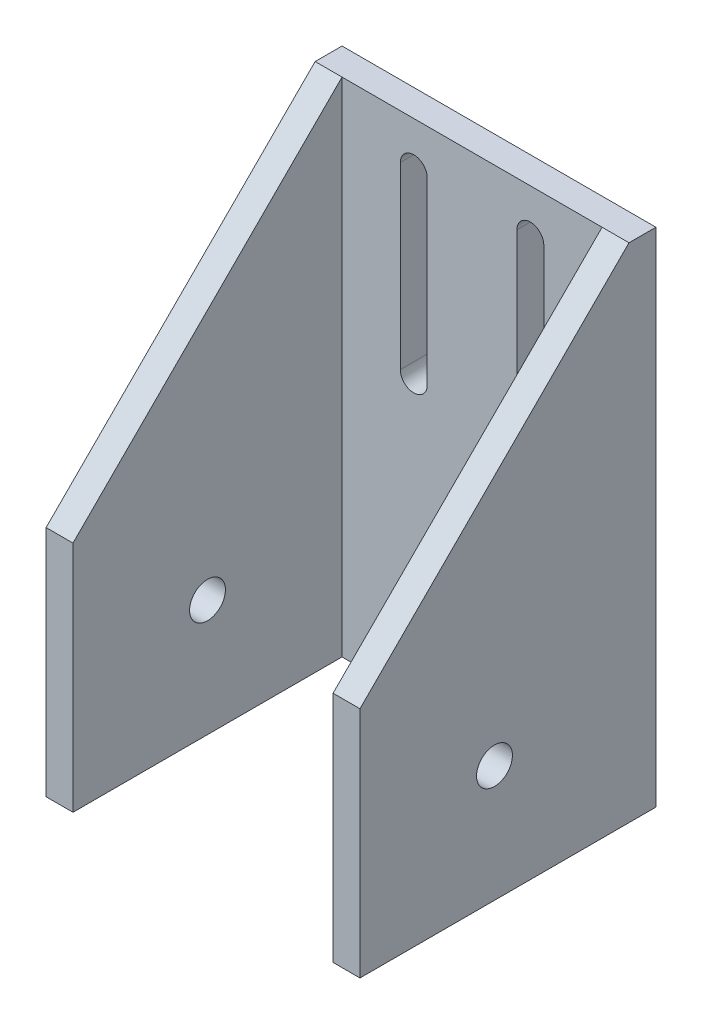
ISO-10303-21;
HEADER;
FILE_DESCRIPTION(('STEP AP214'),'2;1');
FILE_NAME('part.step','',(''),(''),'','','');
FILE_SCHEMA(('AUTOMOTIVE_DESIGN { 1 0 10303 214 1 1 1 1 }'));
ENDSEC;
DATA;
#1=APPLICATION_CONTEXT('core data for automotive mechanical design processes');
#2=APPLICATION_PROTOCOL_DEFINITION('international standard','automotive_design',2000,#1);
#3=PRODUCT_CONTEXT('',#1,'mechanical');
#4=PRODUCT('Part','Part','',(#3));
#5=PRODUCT_RELATED_PRODUCT_CATEGORY('part','',(#4));
#6=PRODUCT_DEFINITION_FORMATION('','',#4);
#7=PRODUCT_DEFINITION_CONTEXT('part definition',#1,'design');
#8=PRODUCT_DEFINITION('design','',#6,#7);
#9=PRODUCT_DEFINITION_SHAPE('','',#8);
#10=(LENGTH_UNIT() NAMED_UNIT(*) SI_UNIT(.MILLI.,.METRE.));
#11=(NAMED_UNIT(*) PLANE_ANGLE_UNIT() SI_UNIT($,.RADIAN.));
#12=(NAMED_UNIT(*) SI_UNIT($,.STERADIAN.) SOLID_ANGLE_UNIT());
#13=UNCERTAINTY_MEASURE_WITH_UNIT(LENGTH_MEASURE(1.E-05),#10,'distance_accuracy_value','');
#14=(GEOMETRIC_REPRESENTATION_CONTEXT(3) GLOBAL_UNCERTAINTY_ASSIGNED_CONTEXT((#13)) GLOBAL_UNIT_ASSIGNED_CONTEXT((#10,
#11,#12)) REPRESENTATION_CONTEXT('',''));
#15=CARTESIAN_POINT('',(0.,0.,0.));
#16=DIRECTION('',(0.,0.,1.));
#17=DIRECTION('',(1.,0.,0.));
#18=AXIS2_PLACEMENT_3D('',#15,#16,#17);
#19=CARTESIAN_POINT('',(17.5,28.,3.));
#20=DIRECTION('',(0.,0.707106781186547,0.707106781186547));
#21=DIRECTION('',(0.,-0.707106781186548,0.707106781186548));
#22=AXIS2_PLACEMENT_3D('',#19,#20,#21);
#23=PLANE('',#22);
#24=DIRECTION('',(0.,-0.707106781186548,0.707106781186548));
#25=VECTOR('',#24,1.);
#26=CARTESIAN_POINT('',(-14.5,28.,3.));
#27=LINE('',#26,#25);
#28=CARTESIAN_POINT('',(-14.5,28.,3.));
#29=VERTEX_POINT('',#28);
#30=CARTESIAN_POINT('',(-14.5,-2.,33.));
#31=VERTEX_POINT('',#30);
#32=EDGE_CURVE('E155',#29,#31,#27,.T.);
#33=ORIENTED_EDGE('',*,*,#32,.F.);
#34=DIRECTION('',(-1.,0.,0.));
#35=VECTOR('',#34,1.);
#36=CARTESIAN_POINT('',(-17.5,28.,3.));
#37=LINE('',#36,#35);
#38=CARTESIAN_POINT('',(-17.5,28.,3.));
#39=VERTEX_POINT('',#38);
#40=EDGE_CURVE('E258',#29,#39,#37,.T.);
#41=ORIENTED_EDGE('',*,*,#40,.T.);
#42=DIRECTION('',(0.,0.707106781186547,-0.707106781186547));
#43=VECTOR('',#42,1.);
#44=CARTESIAN_POINT('',(-17.5,28.,3.));
#45=LINE('',#44,#43);
#46=CARTESIAN_POINT('',(-17.5,-2.,33.));
#47=VERTEX_POINT('',#46);
#48=EDGE_CURVE('E163',#47,#39,#45,.T.);
#49=ORIENTED_EDGE('',*,*,#48,.F.);
#50=DIRECTION('',(-1.,0.,0.));
#51=VECTOR('',#50,1.);
#52=CARTESIAN_POINT('',(-17.5,-2.,33.));
#53=LINE('',#52,#51);
#54=EDGE_CURVE('E167',#31,#47,#53,.T.);
#55=ORIENTED_EDGE('',*,*,#54,.F.);
#56=EDGE_LOOP('',(#33,#41,#49,#55));
#57=FACE_BOUND('',#56,.T.);
#58=ADVANCED_FACE('F37',(#57),#23,.T.);
#59=CARTESIAN_POINT('',(0.,0.,3.));
#60=DIRECTION('',(0.,0.,1.));
#61=DIRECTION('',(1.,0.,0.));
#62=AXIS2_PLACEMENT_3D('',#59,#60,#61);
#63=PLANE('',#62);
#64=DIRECTION('',(0.,-1.,0.));
#65=VECTOR('',#64,1.);
#66=CARTESIAN_POINT('',(14.5,-2.,3.));
#67=LINE('',#66,#65);
#68=CARTESIAN_POINT('',(14.5,28.,3.));
#69=VERTEX_POINT('',#68);
#70=CARTESIAN_POINT('',(14.5,-28.,3.));
#71=VERTEX_POINT('',#70);
#72=EDGE_CURVE('E184',#69,#71,#67,.T.);
#73=ORIENTED_EDGE('',*,*,#72,.F.);
#74=DIRECTION('',(1.,0.,0.));
#75=VECTOR('',#74,1.);
#76=CARTESIAN_POINT('',(-14.5,28.,3.));
#77=LINE('',#76,#75);
#78=EDGE_CURVE('E322',#29,#69,#77,.T.);
#79=ORIENTED_EDGE('',*,*,#78,.F.);
#80=DIRECTION('',(0.,1.,0.));
#81=VECTOR('',#80,1.);
#82=CARTESIAN_POINT('',(-14.5,-2.,3.));
#83=LINE('',#82,#81);
#84=CARTESIAN_POINT('',(-14.5,-28.,3.));
#85=VERTEX_POINT('',#84);
#86=EDGE_CURVE('E58',#85,#29,#83,.T.);
#87=ORIENTED_EDGE('',*,*,#86,.F.);
#88=DIRECTION('',(1.,0.,0.));
#89=VECTOR('',#88,1.);
#90=CARTESIAN_POINT('',(-17.5,-28.,3.));
#91=LINE('',#90,#89);
#92=EDGE_CURVE('E53',#85,#71,#91,.T.);
#93=ORIENTED_EDGE('',*,*,#92,.T.);
#94=EDGE_LOOP('',(#73,#79,#87,#93));
#95=FACE_BOUND('',#94,.T.);
#96=CARTESIAN_POINT('',(6.5,23.,3.));
#97=DIRECTION('',(0.,0.,1.));
#98=DIRECTION('',(-1.,0.,0.));
#99=AXIS2_PLACEMENT_3D('',#96,#97,#98);
#100=CIRCLE('',#99,1.5);
#101=CARTESIAN_POINT('',(8.,23.,3.));
#102=VERTEX_POINT('',#101);
#103=CARTESIAN_POINT('',(5.,23.,3.));
#104=VERTEX_POINT('',#103);
#105=EDGE_CURVE('E187',#102,#104,#100,.T.);
#106=ORIENTED_EDGE('',*,*,#105,.F.);
#107=DIRECTION('',(0.,1.,0.));
#108=VECTOR('',#107,1.);
#109=CARTESIAN_POINT('',(8.,23.,3.));
#110=LINE('',#109,#108);
#111=CARTESIAN_POINT('',(8.,3.,3.));
#112=VERTEX_POINT('',#111);
#113=EDGE_CURVE('E197',#112,#102,#110,.T.);
#114=ORIENTED_EDGE('',*,*,#113,.F.);
#115=CARTESIAN_POINT('',(6.5,3.,3.));
#116=DIRECTION('',(0.,0.,1.));
#117=DIRECTION('',(-1.,0.,0.));
#118=AXIS2_PLACEMENT_3D('',#115,#116,#117);
#119=CIRCLE('',#118,1.5);
#120=CARTESIAN_POINT('',(5.,3.,3.));
#121=VERTEX_POINT('',#120);
#122=EDGE_CURVE('E194',#121,#112,#119,.T.);
#123=ORIENTED_EDGE('',*,*,#122,.F.);
#124=DIRECTION('',(0.,-1.,0.));
#125=VECTOR('',#124,1.);
#126=CARTESIAN_POINT('',(5.,23.,3.));
#127=LINE('',#126,#125);
#128=EDGE_CURVE('E190',#104,#121,#127,.T.);
#129=ORIENTED_EDGE('',*,*,#128,.F.);
#130=EDGE_LOOP('',(#106,#114,#123,#129));
#131=FACE_BOUND('',#130,.T.);
#132=CARTESIAN_POINT('',(-6.5,23.,3.));
#133=DIRECTION('',(0.,0.,1.));
#134=DIRECTION('',(1.,0.,0.));
#135=AXIS2_PLACEMENT_3D('',#132,#133,#134);
#136=CIRCLE('',#135,1.5);
#137=CARTESIAN_POINT('',(-5.,23.,3.));
#138=VERTEX_POINT('',#137);
#139=CARTESIAN_POINT('',(-8.,23.,3.));
#140=VERTEX_POINT('',#139);
#141=EDGE_CURVE('E221',#138,#140,#136,.T.);
#142=ORIENTED_EDGE('',*,*,#141,.F.);
#143=DIRECTION('',(0.,1.,0.));
#144=VECTOR('',#143,1.);
#145=CARTESIAN_POINT('',(-5.,23.,3.));
#146=LINE('',#145,#144);
#147=CARTESIAN_POINT('',(-4.99999999999999,3.,3.));
#148=VERTEX_POINT('',#147);
#149=EDGE_CURVE('E231',#148,#138,#146,.T.);
#150=ORIENTED_EDGE('',*,*,#149,.F.);
#151=CARTESIAN_POINT('',(-6.5,3.,3.));
#152=DIRECTION('',(0.,0.,1.));
#153=DIRECTION('',(1.,0.,0.));
#154=AXIS2_PLACEMENT_3D('',#151,#152,#153);
#155=CIRCLE('',#154,1.5);
#156=CARTESIAN_POINT('',(-8.,3.,3.));
#157=VERTEX_POINT('',#156);
#158=EDGE_CURVE('E228',#157,#148,#155,.T.);
#159=ORIENTED_EDGE('',*,*,#158,.F.);
#160=DIRECTION('',(0.,-1.,0.));
#161=VECTOR('',#160,1.);
#162=CARTESIAN_POINT('',(-8.,23.,3.));
#163=LINE('',#162,#161);
#164=EDGE_CURVE('E224',#140,#157,#163,.T.);
#165=ORIENTED_EDGE('',*,*,#164,.F.);
#166=EDGE_LOOP('',(#142,#150,#159,#165));
#167=FACE_BOUND('',#166,.T.);
#168=ADVANCED_FACE('F355',(#95,#131,#167),#63,.T.);
#169=CARTESIAN_POINT('',(0.,0.,0.));
#170=DIRECTION('',(0.,0.,1.));
#171=DIRECTION('',(1.,0.,0.));
#172=AXIS2_PLACEMENT_3D('',#169,#170,#171);
#173=PLANE('',#172);
#174=CARTESIAN_POINT('',(-6.5,23.,0.));
#175=DIRECTION('',(0.,0.,1.));
#176=DIRECTION('',(1.,0.,0.));
#177=AXIS2_PLACEMENT_3D('',#174,#175,#176);
#178=CIRCLE('',#177,1.5);
#179=CARTESIAN_POINT('',(-5.,23.,0.));
#180=VERTEX_POINT('',#179);
#181=CARTESIAN_POINT('',(-8.,23.,0.));
#182=VERTEX_POINT('',#181);
#183=EDGE_CURVE('E220',#180,#182,#178,.T.);
#184=ORIENTED_EDGE('',*,*,#183,.T.);
#185=DIRECTION('',(0.,-1.,0.));
#186=VECTOR('',#185,1.);
#187=CARTESIAN_POINT('',(-8.,23.,0.));
#188=LINE('',#187,#186);
#189=CARTESIAN_POINT('',(-8.,3.,0.));
#190=VERTEX_POINT('',#189);
#191=EDGE_CURVE('E237',#182,#190,#188,.T.);
#192=ORIENTED_EDGE('',*,*,#191,.T.);
#193=CARTESIAN_POINT('',(-6.5,3.,0.));
#194=DIRECTION('',(0.,0.,1.));
#195=DIRECTION('',(1.,0.,0.));
#196=AXIS2_PLACEMENT_3D('',#193,#194,#195);
#197=CIRCLE('',#196,1.5);
#198=CARTESIAN_POINT('',(-4.99999999999999,3.,0.));
#199=VERTEX_POINT('',#198);
#200=EDGE_CURVE('E240',#190,#199,#197,.T.);
#201=ORIENTED_EDGE('',*,*,#200,.T.);
#202=DIRECTION('',(0.,1.,0.));
#203=VECTOR('',#202,1.);
#204=CARTESIAN_POINT('',(-5.,23.,0.));
#205=LINE('',#204,#203);
#206=EDGE_CURVE('E225',#199,#180,#205,.T.);
#207=ORIENTED_EDGE('',*,*,#206,.T.);
#208=EDGE_LOOP('',(#184,#192,#201,#207));
#209=FACE_BOUND('',#208,.T.);
#210=DIRECTION('',(0.,1.,0.));
#211=VECTOR('',#210,1.);
#212=CARTESIAN_POINT('',(17.5,28.,0.));
#213=LINE('',#212,#211);
#214=CARTESIAN_POINT('',(17.5,-28.,0.));
#215=VERTEX_POINT('',#214);
#216=CARTESIAN_POINT('',(17.5,28.,0.));
#217=VERTEX_POINT('',#216);
#218=EDGE_CURVE('E254',#215,#217,#213,.T.);
#219=ORIENTED_EDGE('',*,*,#218,.F.);
#220=DIRECTION('',(1.,0.,0.));
#221=VECTOR('',#220,1.);
#222=CARTESIAN_POINT('',(-17.5,-28.,0.));
#223=LINE('',#222,#221);
#224=CARTESIAN_POINT('',(-17.5,-28.,0.));
#225=VERTEX_POINT('',#224);
#226=EDGE_CURVE('E267',#225,#215,#223,.T.);
#227=ORIENTED_EDGE('',*,*,#226,.F.);
#228=DIRECTION('',(0.,-1.,0.));
#229=VECTOR('',#228,1.);
#230=CARTESIAN_POINT('',(-17.5,28.,0.));
#231=LINE('',#230,#229);
#232=CARTESIAN_POINT('',(-17.5,28.,0.));
#233=VERTEX_POINT('',#232);
#234=EDGE_CURVE('E265',#233,#225,#231,.T.);
#235=ORIENTED_EDGE('',*,*,#234,.F.);
#236=DIRECTION('',(-1.,0.,0.));
#237=VECTOR('',#236,1.);
#238=CARTESIAN_POINT('',(-17.5,28.,0.));
#239=LINE('',#238,#237);
#240=EDGE_CURVE('E263',#217,#233,#239,.T.);
#241=ORIENTED_EDGE('',*,*,#240,.F.);
#242=EDGE_LOOP('',(#219,#227,#235,#241));
#243=FACE_BOUND('',#242,.T.);
#244=CARTESIAN_POINT('',(6.5,23.,0.));
#245=DIRECTION('',(0.,0.,1.));
#246=DIRECTION('',(-1.,0.,0.));
#247=AXIS2_PLACEMENT_3D('',#244,#245,#246);
#248=CIRCLE('',#247,1.5);
#249=CARTESIAN_POINT('',(8.,23.,0.));
#250=VERTEX_POINT('',#249);
#251=CARTESIAN_POINT('',(5.,23.,0.));
#252=VERTEX_POINT('',#251);
#253=EDGE_CURVE('E186',#250,#252,#248,.T.);
#254=ORIENTED_EDGE('',*,*,#253,.T.);
#255=DIRECTION('',(0.,-1.,0.));
#256=VECTOR('',#255,1.);
#257=CARTESIAN_POINT('',(5.,23.,0.));
#258=LINE('',#257,#256);
#259=CARTESIAN_POINT('',(5.,3.,0.));
#260=VERTEX_POINT('',#259);
#261=EDGE_CURVE('E203',#252,#260,#258,.T.);
#262=ORIENTED_EDGE('',*,*,#261,.T.);
#263=CARTESIAN_POINT('',(6.5,3.,0.));
#264=DIRECTION('',(0.,0.,1.));
#265=DIRECTION('',(-1.,0.,0.));
#266=AXIS2_PLACEMENT_3D('',#263,#264,#265);
#267=CIRCLE('',#266,1.5);
#268=CARTESIAN_POINT('',(8.,3.,0.));
#269=VERTEX_POINT('',#268);
#270=EDGE_CURVE('E206',#260,#269,#267,.T.);
#271=ORIENTED_EDGE('',*,*,#270,.T.);
#272=DIRECTION('',(0.,1.,0.));
#273=VECTOR('',#272,1.);
#274=CARTESIAN_POINT('',(8.,23.,0.));
#275=LINE('',#274,#273);
#276=EDGE_CURVE('E191',#269,#250,#275,.T.);
#277=ORIENTED_EDGE('',*,*,#276,.T.);
#278=EDGE_LOOP('',(#254,#262,#271,#277));
#279=FACE_BOUND('',#278,.T.);
#280=ADVANCED_FACE('F283',(#209,#243,#279),#173,.F.);
#281=CARTESIAN_POINT('',(17.5,28.,3.));
#282=DIRECTION('',(-1.,0.,0.));
#283=DIRECTION('',(0.,-1.,0.));
#284=AXIS2_PLACEMENT_3D('',#281,#282,#283);
#285=PLANE('',#284);
#286=DIRECTION('',(0.,0.,-1.));
#287=VECTOR('',#286,1.);
#288=CARTESIAN_POINT('',(17.5,28.,3.));
#289=LINE('',#288,#287);
#290=CARTESIAN_POINT('',(17.5,28.,3.));
#291=VERTEX_POINT('',#290);
#292=EDGE_CURVE('E11',#291,#217,#289,.T.);
#293=ORIENTED_EDGE('',*,*,#292,.F.);
#294=DIRECTION('',(0.,0.707106781186547,-0.707106781186547));
#295=VECTOR('',#294,1.);
#296=CARTESIAN_POINT('',(17.5,28.,3.));
#297=LINE('',#296,#295);
#298=CARTESIAN_POINT('',(17.5,-2.,33.));
#299=VERTEX_POINT('',#298);
#300=EDGE_CURVE('E296',#299,#291,#297,.T.);
#301=ORIENTED_EDGE('',*,*,#300,.F.);
#302=DIRECTION('',(0.,1.,0.));
#303=VECTOR('',#302,1.);
#304=CARTESIAN_POINT('',(17.5,-2.,33.));
#305=LINE('',#304,#303);
#306=CARTESIAN_POINT('',(17.5,-28.,33.));
#307=VERTEX_POINT('',#306);
#308=EDGE_CURVE('E295',#307,#299,#305,.T.);
#309=ORIENTED_EDGE('',*,*,#308,.F.);
#310=DIRECTION('',(0.,0.,-1.));
#311=VECTOR('',#310,1.);
#312=CARTESIAN_POINT('',(17.5,-28.,3.));
#313=LINE('',#312,#311);
#314=EDGE_CURVE('E260',#307,#215,#313,.T.);
#315=ORIENTED_EDGE('',*,*,#314,.T.);
#316=ORIENTED_EDGE('',*,*,#218,.T.);
#317=EDGE_LOOP('',(#293,#301,#309,#315,#316));
#318=FACE_BOUND('',#317,.T.);
#319=CARTESIAN_POINT('',(17.5,-15.,18.));
#320=DIRECTION('',(-1.,0.,0.));
#321=DIRECTION('',(0.,-1.,0.));
#322=AXIS2_PLACEMENT_3D('',#319,#320,#321);
#323=CIRCLE('',#322,2.);
#324=CARTESIAN_POINT('',(17.5,-17.,18.));
#325=VERTEX_POINT('',#324);
#326=EDGE_CURVE('E331',#325,#325,#323,.T.);
#327=ORIENTED_EDGE('',*,*,#326,.T.);
#328=EDGE_LOOP('',(#327));
#329=FACE_BOUND('',#328,.T.);
#330=ADVANCED_FACE('F39',(#318,#329),#285,.F.);
#331=CARTESIAN_POINT('',(-17.5,28.,3.));
#332=DIRECTION('',(0.,-1.,0.));
#333=DIRECTION('',(0.,0.,-1.));
#334=AXIS2_PLACEMENT_3D('',#331,#332,#333);
#335=PLANE('',#334);
#336=ORIENTED_EDGE('',*,*,#240,.T.);
#337=DIRECTION('',(0.,0.,-1.));
#338=VECTOR('',#337,1.);
#339=CARTESIAN_POINT('',(-17.5,28.,3.));
#340=LINE('',#339,#338);
#341=EDGE_CURVE('E46',#39,#233,#340,.T.);
#342=ORIENTED_EDGE('',*,*,#341,.F.);
#343=ORIENTED_EDGE('',*,*,#40,.F.);
#344=ORIENTED_EDGE('',*,*,#78,.T.);
#345=EDGE_CURVE('E255',#291,#69,#37,.T.);
#346=ORIENTED_EDGE('',*,*,#345,.F.);
#347=ORIENTED_EDGE('',*,*,#292,.T.);
#348=EDGE_LOOP('',(#336,#342,#343,#344,#346,#347));
#349=FACE_BOUND('',#348,.T.);
#350=ADVANCED_FACE('F325',(#349),#335,.F.);
#351=CARTESIAN_POINT('',(-17.5,28.,3.));
#352=DIRECTION('',(1.,0.,0.));
#353=DIRECTION('',(0.,1.,0.));
#354=AXIS2_PLACEMENT_3D('',#351,#352,#353);
#355=PLANE('',#354);
#356=CARTESIAN_POINT('',(-17.5,-15.,18.));
#357=DIRECTION('',(-1.,0.,0.));
#358=DIRECTION('',(0.,-1.,0.));
#359=AXIS2_PLACEMENT_3D('',#356,#357,#358);
#360=CIRCLE('',#359,2.);
#361=CARTESIAN_POINT('',(-17.5,-17.,18.));
#362=VERTEX_POINT('',#361);
#363=EDGE_CURVE('E328',#362,#362,#360,.T.);
#364=ORIENTED_EDGE('',*,*,#363,.F.);
#365=EDGE_LOOP('',(#364));
#366=FACE_BOUND('',#365,.T.);
#367=ORIENTED_EDGE('',*,*,#234,.T.);
#368=DIRECTION('',(0.,0.,-1.));
#369=VECTOR('',#368,1.);
#370=CARTESIAN_POINT('',(-17.5,-28.,3.));
#371=LINE('',#370,#369);
#372=CARTESIAN_POINT('',(-17.5,-28.,33.));
#373=VERTEX_POINT('',#372);
#374=EDGE_CURVE('E271',#373,#225,#371,.T.);
#375=ORIENTED_EDGE('',*,*,#374,.F.);
#376=DIRECTION('',(0.,-1.,0.));
#377=VECTOR('',#376,1.);
#378=CARTESIAN_POINT('',(-17.5,-2.,33.));
#379=LINE('',#378,#377);
#380=EDGE_CURVE('E179',#47,#373,#379,.T.);
#381=ORIENTED_EDGE('',*,*,#380,.F.);
#382=ORIENTED_EDGE('',*,*,#48,.T.);
#383=ORIENTED_EDGE('',*,*,#341,.T.);
#384=EDGE_LOOP('',(#367,#375,#381,#382,#383));
#385=FACE_BOUND('',#384,.T.);
#386=ADVANCED_FACE('F278',(#366,#385),#355,.F.);
#387=CARTESIAN_POINT('',(-17.5,-28.,3.));
#388=DIRECTION('',(0.,1.,0.));
#389=DIRECTION('',(0.,0.,1.));
#390=AXIS2_PLACEMENT_3D('',#387,#388,#389);
#391=PLANE('',#390);
#392=ORIENTED_EDGE('',*,*,#226,.T.);
#393=ORIENTED_EDGE('',*,*,#314,.F.);
#394=DIRECTION('',(1.,0.,0.));
#395=VECTOR('',#394,1.);
#396=CARTESIAN_POINT('',(17.5,-28.,33.));
#397=LINE('',#396,#395);
#398=CARTESIAN_POINT('',(14.5,-28.,33.));
#399=VERTEX_POINT('',#398);
#400=EDGE_CURVE('E308',#399,#307,#397,.T.);
#401=ORIENTED_EDGE('',*,*,#400,.F.);
#402=DIRECTION('',(0.,0.,-1.));
#403=VECTOR('',#402,1.);
#404=CARTESIAN_POINT('',(14.5,-28.,33.));
#405=LINE('',#404,#403);
#406=EDGE_CURVE('E307',#399,#71,#405,.T.);
#407=ORIENTED_EDGE('',*,*,#406,.T.);
#408=ORIENTED_EDGE('',*,*,#92,.F.);
#409=DIRECTION('',(0.,0.,-1.));
#410=VECTOR('',#409,1.);
#411=CARTESIAN_POINT('',(-14.5,-28.,33.));
#412=LINE('',#411,#410);
#413=CARTESIAN_POINT('',(-14.5,-28.,33.));
#414=VERTEX_POINT('',#413);
#415=EDGE_CURVE('E172',#414,#85,#412,.T.);
#416=ORIENTED_EDGE('',*,*,#415,.F.);
#417=DIRECTION('',(1.,0.,0.));
#418=VECTOR('',#417,1.);
#419=CARTESIAN_POINT('',(-17.5,-28.,33.));
#420=LINE('',#419,#418);
#421=EDGE_CURVE('E176',#373,#414,#420,.T.);
#422=ORIENTED_EDGE('',*,*,#421,.F.);
#423=ORIENTED_EDGE('',*,*,#374,.T.);
#424=EDGE_LOOP('',(#392,#393,#401,#407,#408,#416,#422,#423));
#425=FACE_BOUND('',#424,.T.);
#426=ADVANCED_FACE('F286',(#425),#391,.F.);
#427=CARTESIAN_POINT('',(-6.5,23.,3.));
#428=DIRECTION('',(0.,0.,-1.));
#429=DIRECTION('',(-1.,0.,0.));
#430=AXIS2_PLACEMENT_3D('',#427,#428,#429);
#431=CYLINDRICAL_SURFACE('',#430,1.5);
#432=ORIENTED_EDGE('',*,*,#183,.F.);
#433=DIRECTION('',(0.,0.,-1.));
#434=VECTOR('',#433,1.);
#435=CARTESIAN_POINT('',(-5.,23.,3.));
#436=LINE('',#435,#434);
#437=EDGE_CURVE('E234',#138,#180,#436,.T.);
#438=ORIENTED_EDGE('',*,*,#437,.F.);
#439=ORIENTED_EDGE('',*,*,#141,.T.);
#440=DIRECTION('',(0.,0.,-1.));
#441=VECTOR('',#440,1.);
#442=CARTESIAN_POINT('',(-8.,23.,3.));
#443=LINE('',#442,#441);
#444=EDGE_CURVE('E251',#140,#182,#443,.T.);
#445=ORIENTED_EDGE('',*,*,#444,.T.);
#446=EDGE_LOOP('',(#432,#438,#439,#445));
#447=FACE_BOUND('',#446,.T.);
#448=ADVANCED_FACE('F411',(#447),#431,.F.);
#449=CARTESIAN_POINT('',(-8.,23.,3.));
#450=DIRECTION('',(1.,0.,0.));
#451=DIRECTION('',(0.,1.,0.));
#452=AXIS2_PLACEMENT_3D('',#449,#450,#451);
#453=PLANE('',#452);
#454=ORIENTED_EDGE('',*,*,#191,.F.);
#455=ORIENTED_EDGE('',*,*,#444,.F.);
#456=ORIENTED_EDGE('',*,*,#164,.T.);
#457=DIRECTION('',(0.,0.,-1.));
#458=VECTOR('',#457,1.);
#459=CARTESIAN_POINT('',(-8.,3.,3.));
#460=LINE('',#459,#458);
#461=EDGE_CURVE('E249',#157,#190,#460,.T.);
#462=ORIENTED_EDGE('',*,*,#461,.T.);
#463=EDGE_LOOP('',(#454,#455,#456,#462));
#464=FACE_BOUND('',#463,.T.);
#465=ADVANCED_FACE('F415',(#464),#453,.T.);
#466=CARTESIAN_POINT('',(-6.5,3.,3.));
#467=DIRECTION('',(0.,0.,-1.));
#468=DIRECTION('',(-1.,0.,0.));
#469=AXIS2_PLACEMENT_3D('',#466,#467,#468);
#470=CYLINDRICAL_SURFACE('',#469,1.5);
#471=ORIENTED_EDGE('',*,*,#200,.F.);
#472=ORIENTED_EDGE('',*,*,#461,.F.);
#473=ORIENTED_EDGE('',*,*,#158,.T.);
#474=DIRECTION('',(0.,0.,-1.));
#475=VECTOR('',#474,1.);
#476=CARTESIAN_POINT('',(-4.99999999999999,3.,3.));
#477=LINE('',#476,#475);
#478=EDGE_CURVE('E247',#148,#199,#477,.T.);
#479=ORIENTED_EDGE('',*,*,#478,.T.);
#480=EDGE_LOOP('',(#471,#472,#473,#479));
#481=FACE_BOUND('',#480,.T.);
#482=ADVANCED_FACE('F423',(#481),#470,.F.);
#483=CARTESIAN_POINT('',(-5.,23.,3.));
#484=DIRECTION('',(-1.,0.,0.));
#485=DIRECTION('',(0.,-1.,0.));
#486=AXIS2_PLACEMENT_3D('',#483,#484,#485);
#487=PLANE('',#486);
#488=ORIENTED_EDGE('',*,*,#206,.F.);
#489=ORIENTED_EDGE('',*,*,#478,.F.);
#490=ORIENTED_EDGE('',*,*,#149,.T.);
#491=ORIENTED_EDGE('',*,*,#437,.T.);
#492=EDGE_LOOP('',(#488,#489,#490,#491));
#493=FACE_BOUND('',#492,.T.);
#494=ADVANCED_FACE('F431',(#493),#487,.T.);
#495=CARTESIAN_POINT('',(6.5,23.,3.));
#496=DIRECTION('',(0.,0.,-1.));
#497=DIRECTION('',(-1.,0.,0.));
#498=AXIS2_PLACEMENT_3D('',#495,#496,#497);
#499=CYLINDRICAL_SURFACE('',#498,1.5);
#500=ORIENTED_EDGE('',*,*,#253,.F.);
#501=DIRECTION('',(0.,0.,-1.));
#502=VECTOR('',#501,1.);
#503=CARTESIAN_POINT('',(8.,23.,3.));
#504=LINE('',#503,#502);
#505=EDGE_CURVE('E200',#102,#250,#504,.T.);
#506=ORIENTED_EDGE('',*,*,#505,.F.);
#507=ORIENTED_EDGE('',*,*,#105,.T.);
#508=DIRECTION('',(0.,0.,-1.));
#509=VECTOR('',#508,1.);
#510=CARTESIAN_POINT('',(5.,23.,3.));
#511=LINE('',#510,#509);
#512=EDGE_CURVE('E217',#104,#252,#511,.T.);
#513=ORIENTED_EDGE('',*,*,#512,.T.);
#514=EDGE_LOOP('',(#500,#506,#507,#513));
#515=FACE_BOUND('',#514,.T.);
#516=ADVANCED_FACE('F439',(#515),#499,.F.);
#517=CARTESIAN_POINT('',(5.,23.,3.));
#518=DIRECTION('',(1.,0.,0.));
#519=DIRECTION('',(0.,1.,0.));
#520=AXIS2_PLACEMENT_3D('',#517,#518,#519);
#521=PLANE('',#520);
#522=ORIENTED_EDGE('',*,*,#261,.F.);
#523=ORIENTED_EDGE('',*,*,#512,.F.);
#524=ORIENTED_EDGE('',*,*,#128,.T.);
#525=DIRECTION('',(0.,0.,-1.));
#526=VECTOR('',#525,1.);
#527=CARTESIAN_POINT('',(5.,3.,3.));
#528=LINE('',#527,#526);
#529=EDGE_CURVE('E215',#121,#260,#528,.T.);
#530=ORIENTED_EDGE('',*,*,#529,.T.);
#531=EDGE_LOOP('',(#522,#523,#524,#530));
#532=FACE_BOUND('',#531,.T.);
#533=ADVANCED_FACE('F447',(#532),#521,.T.);
#534=CARTESIAN_POINT('',(6.5,3.,3.));
#535=DIRECTION('',(0.,0.,-1.));
#536=DIRECTION('',(-1.,0.,0.));
#537=AXIS2_PLACEMENT_3D('',#534,#535,#536);
#538=CYLINDRICAL_SURFACE('',#537,1.5);
#539=ORIENTED_EDGE('',*,*,#270,.F.);
#540=ORIENTED_EDGE('',*,*,#529,.F.);
#541=ORIENTED_EDGE('',*,*,#122,.T.);
#542=DIRECTION('',(0.,0.,-1.));
#543=VECTOR('',#542,1.);
#544=CARTESIAN_POINT('',(8.,3.,3.));
#545=LINE('',#544,#543);
#546=EDGE_CURVE('E213',#112,#269,#545,.T.);
#547=ORIENTED_EDGE('',*,*,#546,.T.);
#548=EDGE_LOOP('',(#539,#540,#541,#547));
#549=FACE_BOUND('',#548,.T.);
#550=ADVANCED_FACE('F455',(#549),#538,.F.);
#551=CARTESIAN_POINT('',(8.,23.,3.));
#552=DIRECTION('',(-1.,0.,0.));
#553=DIRECTION('',(0.,0.,1.));
#554=AXIS2_PLACEMENT_3D('',#551,#552,#553);
#555=PLANE('',#554);
#556=ORIENTED_EDGE('',*,*,#276,.F.);
#557=ORIENTED_EDGE('',*,*,#546,.F.);
#558=ORIENTED_EDGE('',*,*,#113,.T.);
#559=ORIENTED_EDGE('',*,*,#505,.T.);
#560=EDGE_LOOP('',(#556,#557,#558,#559));
#561=FACE_BOUND('',#560,.T.);
#562=ADVANCED_FACE('F375',(#561),#555,.T.);
#563=CARTESIAN_POINT('',(-14.5,-2.,33.));
#564=DIRECTION('',(-1.,0.,0.));
#565=DIRECTION('',(0.,-1.,0.));
#566=AXIS2_PLACEMENT_3D('',#563,#564,#565);
#567=PLANE('',#566);
#568=CARTESIAN_POINT('',(-14.5,-15.,18.));
#569=DIRECTION('',(-1.,0.,0.));
#570=DIRECTION('',(0.,-1.,0.));
#571=AXIS2_PLACEMENT_3D('',#568,#569,#570);
#572=CIRCLE('',#571,2.);
#573=CARTESIAN_POINT('',(-14.5,-17.,18.));
#574=VERTEX_POINT('',#573);
#575=EDGE_CURVE('E311',#574,#574,#572,.T.);
#576=ORIENTED_EDGE('',*,*,#575,.T.);
#577=EDGE_LOOP('',(#576));
#578=FACE_BOUND('',#577,.T.);
#579=ORIENTED_EDGE('',*,*,#86,.T.);
#580=ORIENTED_EDGE('',*,*,#32,.T.);
#581=DIRECTION('',(0.,1.,0.));
#582=VECTOR('',#581,1.);
#583=CARTESIAN_POINT('',(-14.5,-2.,33.));
#584=LINE('',#583,#582);
#585=EDGE_CURVE('E160',#414,#31,#584,.T.);
#586=ORIENTED_EDGE('',*,*,#585,.F.);
#587=ORIENTED_EDGE('',*,*,#415,.T.);
#588=EDGE_LOOP('',(#579,#580,#586,#587));
#589=FACE_BOUND('',#588,.T.);
#590=ADVANCED_FACE('F157',(#578,#589),#567,.F.);
#591=CARTESIAN_POINT('',(0.,0.,33.));
#592=DIRECTION('',(0.,0.,1.));
#593=DIRECTION('',(1.,0.,0.));
#594=AXIS2_PLACEMENT_3D('',#591,#592,#593);
#595=PLANE('',#594);
#596=ORIENTED_EDGE('',*,*,#380,.T.);
#597=ORIENTED_EDGE('',*,*,#421,.T.);
#598=ORIENTED_EDGE('',*,*,#585,.T.);
#599=ORIENTED_EDGE('',*,*,#54,.T.);
#600=EDGE_LOOP('',(#596,#597,#598,#599));
#601=FACE_BOUND('',#600,.T.);
#602=ADVANCED_FACE('F174',(#601),#595,.T.);
#603=CARTESIAN_POINT('',(14.5,-2.,33.));
#604=DIRECTION('',(1.,0.,0.));
#605=DIRECTION('',(0.,1.,0.));
#606=AXIS2_PLACEMENT_3D('',#603,#604,#605);
#607=PLANE('',#606);
#608=CARTESIAN_POINT('',(14.5,-15.,18.));
#609=DIRECTION('',(1.,0.,0.));
#610=DIRECTION('',(0.,1.,0.));
#611=AXIS2_PLACEMENT_3D('',#608,#609,#610);
#612=CIRCLE('',#611,2.);
#613=CARTESIAN_POINT('',(14.5,-13.,18.));
#614=VERTEX_POINT('',#613);
#615=EDGE_CURVE('E41',#614,#614,#612,.T.);
#616=ORIENTED_EDGE('',*,*,#615,.T.);
#617=EDGE_LOOP('',(#616));
#618=FACE_BOUND('',#617,.T.);
#619=ORIENTED_EDGE('',*,*,#72,.T.);
#620=ORIENTED_EDGE('',*,*,#406,.F.);
#621=DIRECTION('',(0.,-1.,0.));
#622=VECTOR('',#621,1.);
#623=CARTESIAN_POINT('',(14.5,-2.,33.));
#624=LINE('',#623,#622);
#625=CARTESIAN_POINT('',(14.5,-2.,33.));
#626=VERTEX_POINT('',#625);
#627=EDGE_CURVE('E302',#626,#399,#624,.T.);
#628=ORIENTED_EDGE('',*,*,#627,.F.);
#629=DIRECTION('',(0.,0.707106781186548,-0.707106781186548));
#630=VECTOR('',#629,1.);
#631=CARTESIAN_POINT('',(14.5,28.,3.));
#632=LINE('',#631,#630);
#633=EDGE_CURVE('E164',#626,#69,#632,.T.);
#634=ORIENTED_EDGE('',*,*,#633,.T.);
#635=EDGE_LOOP('',(#619,#620,#628,#634));
#636=FACE_BOUND('',#635,.T.);
#637=ADVANCED_FACE('F319',(#618,#636),#607,.F.);
#638=CARTESIAN_POINT('',(0.,0.,33.));
#639=DIRECTION('',(0.,0.,-1.));
#640=DIRECTION('',(-1.,0.,0.));
#641=AXIS2_PLACEMENT_3D('',#638,#639,#640);
#642=PLANE('',#641);
#643=ORIENTED_EDGE('',*,*,#308,.T.);
#644=DIRECTION('',(-1.,0.,0.));
#645=VECTOR('',#644,1.);
#646=CARTESIAN_POINT('',(17.5,-2.,33.));
#647=LINE('',#646,#645);
#648=EDGE_CURVE('E299',#299,#626,#647,.T.);
#649=ORIENTED_EDGE('',*,*,#648,.T.);
#650=ORIENTED_EDGE('',*,*,#627,.T.);
#651=ORIENTED_EDGE('',*,*,#400,.T.);
#652=EDGE_LOOP('',(#643,#649,#650,#651));
#653=FACE_BOUND('',#652,.T.);
#654=ADVANCED_FACE('F317',(#653),#642,.F.);
#655=CARTESIAN_POINT('',(17.5,-15.,18.));
#656=DIRECTION('',(-1.,0.,0.));
#657=DIRECTION('',(0.,-1.,0.));
#658=AXIS2_PLACEMENT_3D('',#655,#656,#657);
#659=CYLINDRICAL_SURFACE('',#658,2.);
#660=ORIENTED_EDGE('',*,*,#326,.F.);
#661=EDGE_LOOP('',(#660));
#662=FACE_BOUND('',#661,.T.);
#663=ORIENTED_EDGE('',*,*,#615,.F.);
#664=EDGE_LOOP('',(#663));
#665=FACE_BOUND('',#664,.T.);
#666=ADVANCED_FACE('F340',(#662,#665),#659,.F.);
#667=ORIENTED_EDGE('',*,*,#363,.T.);
#668=EDGE_LOOP('',(#667));
#669=FACE_BOUND('',#668,.T.);
#670=ORIENTED_EDGE('',*,*,#575,.F.);
#671=EDGE_LOOP('',(#670));
#672=FACE_BOUND('',#671,.T.);
#673=ADVANCED_FACE('F342',(#669,#672),#659,.F.);
#674=ORIENTED_EDGE('',*,*,#633,.F.);
#675=ORIENTED_EDGE('',*,*,#648,.F.);
#676=ORIENTED_EDGE('',*,*,#300,.T.);
#677=ORIENTED_EDGE('',*,*,#345,.T.);
#678=EDGE_LOOP('',(#674,#675,#676,#677));
#679=FACE_BOUND('',#678,.T.);
#680=ADVANCED_FACE('F327',(#679),#23,.T.);
#681=CLOSED_SHELL('',(#58,#168,#280,#330,#350,#386,#426,#448,#465,#482,#494,#516,#533,#550,#562,
#590,#602,#637,#654,#666,#673,#680));
#682=MANIFOLD_SOLID_BREP('B2',#681);
#683=ADVANCED_BREP_SHAPE_REPRESENTATION('',(#18,#682),#14);
#684=SHAPE_DEFINITION_REPRESENTATION(#9,#683);
ENDSEC;
END-ISO-10303-21;
